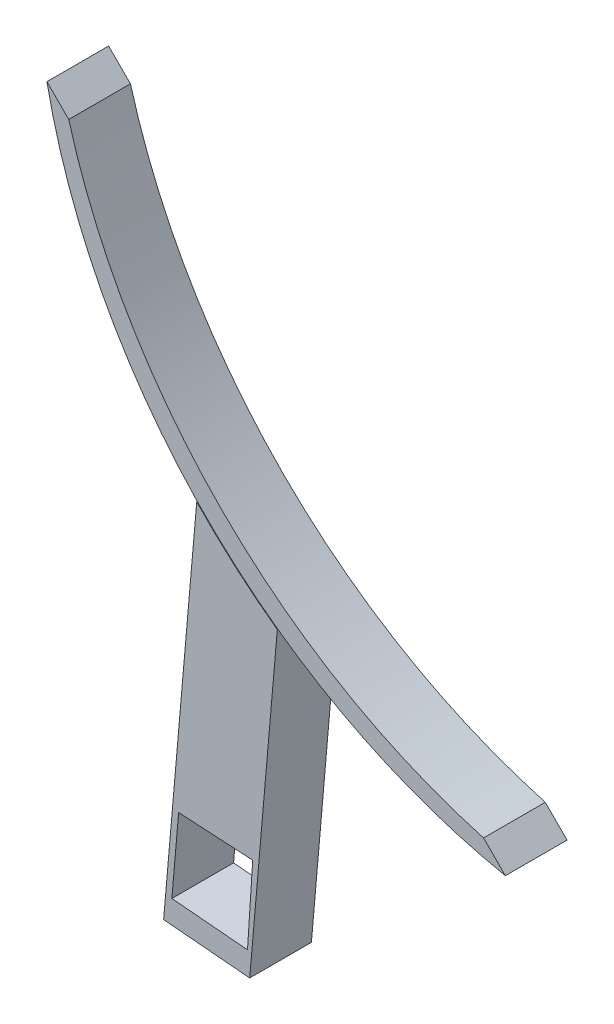
ISO-10303-21;
HEADER;
FILE_DESCRIPTION(('STEP AP214'),'2;1');
FILE_NAME('part.step','',(''),(''),'','','');
FILE_SCHEMA(('AUTOMOTIVE_DESIGN { 1 0 10303 214 1 1 1 1 }'));
ENDSEC;
DATA;
#1=APPLICATION_CONTEXT('core data for automotive mechanical design processes');
#2=APPLICATION_PROTOCOL_DEFINITION('international standard','automotive_design',2000,#1);
#3=PRODUCT_CONTEXT('',#1,'mechanical');
#4=PRODUCT('Part','Part','',(#3));
#5=PRODUCT_RELATED_PRODUCT_CATEGORY('part','',(#4));
#6=PRODUCT_DEFINITION_FORMATION('','',#4);
#7=PRODUCT_DEFINITION_CONTEXT('part definition',#1,'design');
#8=PRODUCT_DEFINITION('design','',#6,#7);
#9=PRODUCT_DEFINITION_SHAPE('','',#8);
#10=(LENGTH_UNIT() NAMED_UNIT(*) SI_UNIT(.MILLI.,.METRE.));
#11=(NAMED_UNIT(*) PLANE_ANGLE_UNIT() SI_UNIT($,.RADIAN.));
#12=(NAMED_UNIT(*) SI_UNIT($,.STERADIAN.) SOLID_ANGLE_UNIT());
#13=UNCERTAINTY_MEASURE_WITH_UNIT(LENGTH_MEASURE(1.E-05),#10,'distance_accuracy_value','');
#14=(GEOMETRIC_REPRESENTATION_CONTEXT(3) GLOBAL_UNCERTAINTY_ASSIGNED_CONTEXT((#13)) GLOBAL_UNIT_ASSIGNED_CONTEXT((#10,
#11,#12)) REPRESENTATION_CONTEXT('',''));
#15=CARTESIAN_POINT('',(0.,0.,0.));
#16=DIRECTION('',(0.,0.,1.));
#17=DIRECTION('',(1.,0.,0.));
#18=AXIS2_PLACEMENT_3D('',#15,#16,#17);
#19=CARTESIAN_POINT('',(28.3799536088554,45.4049632205257,7.5));
#20=DIRECTION('',(0.,0.,-1.));
#21=DIRECTION('',(-1.,0.,0.));
#22=AXIS2_PLACEMENT_3D('',#19,#20,#21);
#23=CYLINDRICAL_SURFACE('',#22,47.4894594322549);
#24=CARTESIAN_POINT('',(28.3799536088554,45.4049632205257,7.5));
#25=DIRECTION('',(0.,0.,1.));
#26=DIRECTION('',(-1.,0.,0.));
#27=AXIS2_PLACEMENT_3D('',#24,#25,#26);
#28=CIRCLE('',#27,47.4894594322549);
#29=CARTESIAN_POINT('',(0.540576615662491,6.93136388541464,7.5));
#30=VERTEX_POINT('',#29);
#31=CARTESIAN_POINT('',(18.9745039631687,-1.14378836456224,7.5));
#32=VERTEX_POINT('',#31);
#33=EDGE_CURVE('E233',#30,#32,#28,.T.);
#34=ORIENTED_EDGE('',*,*,#33,.F.);
#35=DIRECTION('',(0.,0.,-1.));
#36=VECTOR('',#35,1.);
#37=CARTESIAN_POINT('',(0.540576615662492,6.93136388541464,7.50000000000001));
#38=LINE('',#37,#36);
#39=CARTESIAN_POINT('',(0.540576615662492,6.93136388541464,2.54346717419688));
#40=VERTEX_POINT('',#39);
#41=EDGE_CURVE('E180',#30,#40,#38,.T.);
#42=ORIENTED_EDGE('',*,*,#41,.T.);
#43=CARTESIAN_POINT('',(28.3799536088554,45.4049632205257,2.54346717419687));
#44=DIRECTION('',(0.,0.,1.));
#45=DIRECTION('',(1.,0.,0.));
#46=AXIS2_PLACEMENT_3D('',#43,#44,#45);
#47=CIRCLE('',#46,47.4894594322549);
#48=CARTESIAN_POINT('',(-5.98750090869967,12.6310890651629,2.54346717419688));
#49=VERTEX_POINT('',#48);
#50=EDGE_CURVE('E191',#40,#49,#47,.F.);
#51=ORIENTED_EDGE('',*,*,#50,.T.);
#52=DIRECTION('',(0.,0.,-1.));
#53=VECTOR('',#52,1.);
#54=CARTESIAN_POINT('',(-5.98750090869967,12.6310890651629,7.5));
#55=LINE('',#54,#53);
#56=CARTESIAN_POINT('',(-5.98750090869967,12.6310890651629,7.5));
#57=VERTEX_POINT('',#56);
#58=EDGE_CURVE('E186',#49,#57,#55,.F.);
#59=ORIENTED_EDGE('',*,*,#58,.T.);
#60=CARTESIAN_POINT('',(-18.1687979762325,35.9995135748386,7.5));
#61=VERTEX_POINT('',#60);
#62=EDGE_CURVE('E227',#61,#57,#28,.T.);
#63=ORIENTED_EDGE('',*,*,#62,.F.);
#64=DIRECTION('',(0.,0.,-1.));
#65=VECTOR('',#64,1.);
#66=CARTESIAN_POINT('',(-18.1687979762325,35.9995135748386,7.5));
#67=LINE('',#66,#65);
#68=CARTESIAN_POINT('',(-18.1687979762325,35.9995135748386,2.5));
#69=VERTEX_POINT('',#68);
#70=EDGE_CURVE('E242',#61,#69,#67,.T.);
#71=ORIENTED_EDGE('',*,*,#70,.T.);
#72=CARTESIAN_POINT('',(28.3799536088554,45.4049632205257,2.5));
#73=DIRECTION('',(0.,0.,1.));
#74=DIRECTION('',(-1.,0.,0.));
#75=AXIS2_PLACEMENT_3D('',#72,#73,#74);
#76=CIRCLE('',#75,47.4894594322549);
#77=CARTESIAN_POINT('',(18.9745039631687,-1.14378836456224,2.5));
#78=VERTEX_POINT('',#77);
#79=EDGE_CURVE('E217',#69,#78,#76,.T.);
#80=ORIENTED_EDGE('',*,*,#79,.T.);
#81=DIRECTION('',(0.,0.,-1.));
#82=VECTOR('',#81,1.);
#83=CARTESIAN_POINT('',(18.9745039631687,-1.14378836456224,7.5));
#84=LINE('',#83,#82);
#85=EDGE_CURVE('E11',#32,#78,#84,.T.);
#86=ORIENTED_EDGE('',*,*,#85,.F.);
#87=EDGE_LOOP('',(#34,#42,#51,#59,#63,#71,#80,#86));
#88=FACE_BOUND('',#87,.T.);
#89=ADVANCED_FACE('F39',(#88),#23,.T.);
#90=CARTESIAN_POINT('',(18.9745039631687,-1.14378836456224,7.5));
#91=DIRECTION('',(-0.707106781186544,-0.707106781186552,0.));
#92=DIRECTION('',(0.707106781186551,-0.707106781186544,0.));
#93=AXIS2_PLACEMENT_3D('',#90,#91,#92);
#94=PLANE('',#93);
#95=DIRECTION('',(-0.707106781186552,0.707106781186544,0.));
#96=VECTOR('',#95,1.);
#97=CARTESIAN_POINT('',(18.9745039631687,-1.14378836456224,2.5));
#98=LINE('',#97,#96);
#99=CARTESIAN_POINT('',(17.2067370102023,0.623978588404122,2.5));
#100=VERTEX_POINT('',#99);
#101=EDGE_CURVE('E246',#78,#100,#98,.T.);
#102=ORIENTED_EDGE('',*,*,#101,.T.);
#103=DIRECTION('',(0.,0.,-1.));
#104=VECTOR('',#103,1.);
#105=CARTESIAN_POINT('',(17.2067370102023,0.623978588404122,7.5));
#106=LINE('',#105,#104);
#107=CARTESIAN_POINT('',(17.2067370102023,0.623978588404122,7.5));
#108=VERTEX_POINT('',#107);
#109=EDGE_CURVE('E47',#108,#100,#106,.T.);
#110=ORIENTED_EDGE('',*,*,#109,.F.);
#111=DIRECTION('',(-0.707106781186552,0.707106781186544,0.));
#112=VECTOR('',#111,1.);
#113=CARTESIAN_POINT('',(18.9745039631687,-1.14378836456224,7.5));
#114=LINE('',#113,#112);
#115=EDGE_CURVE('E231',#32,#108,#114,.T.);
#116=ORIENTED_EDGE('',*,*,#115,.F.);
#117=ORIENTED_EDGE('',*,*,#85,.T.);
#118=EDGE_LOOP('',(#102,#110,#116,#117));
#119=FACE_BOUND('',#118,.T.);
#120=ADVANCED_FACE('F287',(#119),#94,.F.);
#121=CARTESIAN_POINT('',(30.267113065966,47.2921226776364,7.5));
#122=DIRECTION('',(0.,0.,-1.));
#123=DIRECTION('',(-1.,0.,0.));
#124=AXIS2_PLACEMENT_3D('',#121,#122,#123);
#125=CYLINDRICAL_SURFACE('',#124,48.4612122779787);
#126=CARTESIAN_POINT('',(30.267113065966,47.2921226776364,2.5));
#127=DIRECTION('',(0.,0.,-1.));
#128=DIRECTION('',(-1.,0.,0.));
#129=AXIS2_PLACEMENT_3D('',#126,#127,#128);
#130=CIRCLE('',#129,48.4612122779787);
#131=CARTESIAN_POINT('',(-16.4010310232661,34.2317466218722,2.5));
#132=VERTEX_POINT('',#131);
#133=EDGE_CURVE('E249',#100,#132,#130,.T.);
#134=ORIENTED_EDGE('',*,*,#133,.T.);
#135=DIRECTION('',(0.,0.,-1.));
#136=VECTOR('',#135,1.);
#137=CARTESIAN_POINT('',(-16.4010310232661,34.2317466218722,7.5));
#138=LINE('',#137,#136);
#139=CARTESIAN_POINT('',(-16.4010310232661,34.2317466218722,7.5));
#140=VERTEX_POINT('',#139);
#141=EDGE_CURVE('E258',#140,#132,#138,.T.);
#142=ORIENTED_EDGE('',*,*,#141,.F.);
#143=CARTESIAN_POINT('',(30.267113065966,47.2921226776364,7.5));
#144=DIRECTION('',(0.,0.,-1.));
#145=DIRECTION('',(-1.,0.,0.));
#146=AXIS2_PLACEMENT_3D('',#143,#144,#145);
#147=CIRCLE('',#146,48.4612122779787);
#148=EDGE_CURVE('E236',#108,#140,#147,.T.);
#149=ORIENTED_EDGE('',*,*,#148,.F.);
#150=ORIENTED_EDGE('',*,*,#109,.T.);
#151=EDGE_LOOP('',(#134,#142,#149,#150));
#152=FACE_BOUND('',#151,.T.);
#153=ADVANCED_FACE('F267',(#152),#125,.F.);
#154=CARTESIAN_POINT('',(-18.1687979762325,35.9995135748386,7.5));
#155=DIRECTION('',(-0.707106781186544,-0.707106781186551,0.));
#156=DIRECTION('',(0.707106781186551,-0.707106781186544,0.));
#157=AXIS2_PLACEMENT_3D('',#154,#155,#156);
#158=PLANE('',#157);
#159=DIRECTION('',(-0.707106781186551,0.707106781186544,0.));
#160=VECTOR('',#159,1.);
#161=CARTESIAN_POINT('',(-18.1687979762325,35.9995135748386,2.5));
#162=LINE('',#161,#160);
#163=EDGE_CURVE('E252',#132,#69,#162,.T.);
#164=ORIENTED_EDGE('',*,*,#163,.T.);
#165=ORIENTED_EDGE('',*,*,#70,.F.);
#166=DIRECTION('',(-0.707106781186551,0.707106781186544,0.));
#167=VECTOR('',#166,1.);
#168=CARTESIAN_POINT('',(-18.1687979762325,35.9995135748386,7.5));
#169=LINE('',#168,#167);
#170=EDGE_CURVE('E239',#140,#61,#169,.T.);
#171=ORIENTED_EDGE('',*,*,#170,.F.);
#172=ORIENTED_EDGE('',*,*,#141,.T.);
#173=EDGE_LOOP('',(#164,#165,#171,#172));
#174=FACE_BOUND('',#173,.T.);
#175=ADVANCED_FACE('F277',(#174),#158,.F.);
#176=CARTESIAN_POINT('',(28.3799536088554,45.4049632205257,7.5));
#177=DIRECTION('',(0.,0.,-1.));
#178=DIRECTION('',(-1.,0.,0.));
#179=AXIS2_PLACEMENT_3D('',#176,#177,#178);
#180=PLANE('',#179);
#181=ORIENTED_EDGE('',*,*,#62,.T.);
#182=EDGE_CURVE('E232',#57,#30,#28,.T.);
#183=ORIENTED_EDGE('',*,*,#182,.T.);
#184=ORIENTED_EDGE('',*,*,#33,.T.);
#185=ORIENTED_EDGE('',*,*,#115,.T.);
#186=ORIENTED_EDGE('',*,*,#148,.T.);
#187=ORIENTED_EDGE('',*,*,#170,.T.);
#188=EDGE_LOOP('',(#181,#183,#184,#185,#186,#187));
#189=FACE_BOUND('',#188,.T.);
#190=ADVANCED_FACE('F286',(#189),#180,.F.);
#191=CARTESIAN_POINT('',(28.3799536088554,45.4049632205257,2.5));
#192=DIRECTION('',(0.,0.,-1.));
#193=DIRECTION('',(-1.,0.,0.));
#194=AXIS2_PLACEMENT_3D('',#191,#192,#193);
#195=PLANE('',#194);
#196=ORIENTED_EDGE('',*,*,#79,.F.);
#197=ORIENTED_EDGE('',*,*,#163,.F.);
#198=ORIENTED_EDGE('',*,*,#133,.F.);
#199=ORIENTED_EDGE('',*,*,#101,.F.);
#200=EDGE_LOOP('',(#196,#197,#198,#199));
#201=FACE_BOUND('',#200,.T.);
#202=ADVANCED_FACE('F274',(#201),#195,.T.);
#203=CARTESIAN_POINT('',(28.3799536088554,45.4049632205257,7.5));
#204=DIRECTION('',(0.,0.,-1.));
#205=DIRECTION('',(-1.,0.,0.));
#206=AXIS2_PLACEMENT_3D('',#203,#204,#205);
#207=CYLINDRICAL_SURFACE('',#206,47.4894594322549);
#208=ORIENTED_EDGE('',*,*,#182,.F.);
#209=CARTESIAN_POINT('',(-5.98750090869967,12.6310890651629,7.54346717419688));
#210=VERTEX_POINT('',#209);
#211=EDGE_CURVE('E190',#57,#210,#55,.F.);
#212=ORIENTED_EDGE('',*,*,#211,.T.);
#213=CARTESIAN_POINT('',(28.3799536088554,45.4049632205257,7.54346717419687));
#214=DIRECTION('',(0.,0.,-1.));
#215=DIRECTION('',(-1.,0.,0.));
#216=AXIS2_PLACEMENT_3D('',#213,#214,#215);
#217=CIRCLE('',#216,47.4894594322549);
#218=CARTESIAN_POINT('',(0.54057661566249,6.93136388541465,7.54346717419687));
#219=VERTEX_POINT('',#218);
#220=EDGE_CURVE('E181',#210,#219,#217,.F.);
#221=ORIENTED_EDGE('',*,*,#220,.T.);
#222=EDGE_CURVE('E195',#219,#30,#38,.T.);
#223=ORIENTED_EDGE('',*,*,#222,.T.);
#224=EDGE_LOOP('',(#208,#212,#221,#223));
#225=FACE_BOUND('',#224,.T.);
#226=ADVANCED_FACE('F296',(#225),#207,.F.);
#227=CARTESIAN_POINT('',(-8.669481527788,-18.0240896860062,2.54346717419688));
#228=DIRECTION('',(0.,0.,-1.));
#229=DIRECTION('',(-1.,0.,0.));
#230=AXIS2_PLACEMENT_3D('',#227,#228,#229);
#231=PLANE('',#230);
#232=DIRECTION('',(-0.0648516956035932,-0.997894913093227,0.));
#233=VECTOR('',#232,1.);
#234=CARTESIAN_POINT('',(-1.98574926808029,-18.4584554336569,2.54346717419688));
#235=LINE('',#234,#233);
#236=CARTESIAN_POINT('',(-1.45199004839346,-10.2453222968173,2.54346717419688));
#237=VERTEX_POINT('',#236);
#238=CARTESIAN_POINT('',(-1.8744153117077,-16.7453222968173,2.54346717419688));
#239=VERTEX_POINT('',#238);
#240=EDGE_CURVE('E177',#237,#239,#235,.T.);
#241=ORIENTED_EDGE('',*,*,#240,.F.);
#242=DIRECTION('',(-0.998343017585793,0.0575431945384743,0.));
#243=VECTOR('',#242,1.);
#244=CARTESIAN_POINT('',(-8.19870939639861,-9.85645015858412,2.54346717419688));
#245=LINE('',#244,#243);
#246=CARTESIAN_POINT('',(-7.45199004839346,-9.89949009170432,2.54346717419688));
#247=VERTEX_POINT('',#246);
#248=EDGE_CURVE('E165',#237,#247,#245,.T.);
#249=ORIENTED_EDGE('',*,*,#248,.T.);
#250=DIRECTION('',(-0.0871557427476555,-0.996194698091746,0.));
#251=VECTOR('',#250,1.);
#252=CARTESIAN_POINT('',(-8.16664922093569,-18.0680818125104,2.54346717419688));
#253=LINE('',#252,#251);
#254=CARTESIAN_POINT('',(-8.00400524541287,-16.2090526655555,2.54346717419688));
#255=VERTEX_POINT('',#254);
#256=EDGE_CURVE('E140',#247,#255,#253,.T.);
#257=ORIENTED_EDGE('',*,*,#256,.T.);
#258=DIRECTION('',(-0.996194698091746,0.0871557427476561,0.));
#259=VECTOR('',#258,1.);
#260=CARTESIAN_POINT('',(-8.50683755226518,-16.1650605390513,2.54346717419688));
#261=LINE('',#260,#259);
#262=EDGE_CURVE('E174',#239,#255,#261,.T.);
#263=ORIENTED_EDGE('',*,*,#262,.F.);
#264=EDGE_LOOP('',(#241,#249,#257,#263));
#265=FACE_BOUND('',#264,.T.);
#266=DIRECTION('',(0.087155742747666,0.996194698091745,0.));
#267=VECTOR('',#266,1.);
#268=CARTESIAN_POINT('',(-8.669481527788,-18.0240896860062,2.54346717419688));
#269=LINE('',#268,#267);
#270=CARTESIAN_POINT('',(-8.669481527788,-18.0240896860062,2.54346717419688));
#271=VERTEX_POINT('',#270);
#272=EDGE_CURVE('E213',#271,#49,#269,.T.);
#273=ORIENTED_EDGE('',*,*,#272,.T.);
#274=ORIENTED_EDGE('',*,*,#50,.F.);
#275=DIRECTION('',(0.087155742747666,0.996194698091745,0.));
#276=VECTOR('',#275,1.);
#277=CARTESIAN_POINT('',(-1.69611864114579,-18.6341798852399,2.54346717419688));
#278=LINE('',#277,#276);
#279=CARTESIAN_POINT('',(-1.69611864114579,-18.6341798852399,2.54346717419688));
#280=VERTEX_POINT('',#279);
#281=EDGE_CURVE('E214',#280,#40,#278,.T.);
#282=ORIENTED_EDGE('',*,*,#281,.F.);
#283=DIRECTION('',(-0.996194698091745,0.0871557427476659,0.));
#284=VECTOR('',#283,1.);
#285=CARTESIAN_POINT('',(-8.669481527788,-18.0240896860062,2.54346717419688));
#286=LINE('',#285,#284);
#287=EDGE_CURVE('E185',#280,#271,#286,.T.);
#288=ORIENTED_EDGE('',*,*,#287,.T.);
#289=EDGE_LOOP('',(#273,#274,#282,#288));
#290=FACE_BOUND('',#289,.T.);
#291=ADVANCED_FACE('F309',(#265,#290),#231,.T.);
#292=CARTESIAN_POINT('',(-1.69611864114579,-18.6341798852399,2.54346717419688));
#293=DIRECTION('',(0.996194698091745,-0.087155742747666,0.));
#294=DIRECTION('',(0.087155742747666,0.996194698091745,0.));
#295=AXIS2_PLACEMENT_3D('',#292,#293,#294);
#296=PLANE('',#295);
#297=ORIENTED_EDGE('',*,*,#281,.T.);
#298=ORIENTED_EDGE('',*,*,#41,.F.);
#299=ORIENTED_EDGE('',*,*,#222,.F.);
#300=DIRECTION('',(0.087155742747666,0.996194698091745,0.));
#301=VECTOR('',#300,1.);
#302=CARTESIAN_POINT('',(-1.69611864114579,-18.6341798852399,7.54346717419687));
#303=LINE('',#302,#301);
#304=CARTESIAN_POINT('',(-1.69611864114579,-18.6341798852399,7.54346717419687));
#305=VERTEX_POINT('',#304);
#306=EDGE_CURVE('E218',#305,#219,#303,.T.);
#307=ORIENTED_EDGE('',*,*,#306,.F.);
#308=DIRECTION('',(0.,0.,-1.));
#309=VECTOR('',#308,1.);
#310=CARTESIAN_POINT('',(-1.69611864114579,-18.6341798852399,2.54346717419688));
#311=LINE('',#310,#309);
#312=EDGE_CURVE('E209',#305,#280,#311,.T.);
#313=ORIENTED_EDGE('',*,*,#312,.T.);
#314=EDGE_LOOP('',(#297,#298,#299,#307,#313));
#315=FACE_BOUND('',#314,.T.);
#316=ADVANCED_FACE('F305',(#315),#296,.T.);
#317=CARTESIAN_POINT('',(-8.669481527788,-18.0240896860062,7.54346717419688));
#318=DIRECTION('',(0.,0.,1.));
#319=DIRECTION('',(1.,0.,0.));
#320=AXIS2_PLACEMENT_3D('',#317,#318,#319);
#321=PLANE('',#320);
#322=DIRECTION('',(0.0648516956035932,0.997894913093227,0.));
#323=VECTOR('',#322,1.);
#324=CARTESIAN_POINT('',(-1.8744153117077,-16.7453222968173,7.54346717419687));
#325=LINE('',#324,#323);
#326=CARTESIAN_POINT('',(-1.8744153117077,-16.7453222968173,7.54346717419687));
#327=VERTEX_POINT('',#326);
#328=CARTESIAN_POINT('',(-1.45199004839345,-10.2453222968173,7.54346717419687));
#329=VERTEX_POINT('',#328);
#330=EDGE_CURVE('E62',#327,#329,#325,.T.);
#331=ORIENTED_EDGE('',*,*,#330,.F.);
#332=DIRECTION('',(0.996194698091746,-0.0871557427476561,0.));
#333=VECTOR('',#332,1.);
#334=CARTESIAN_POINT('',(-8.00400524541287,-16.2090526655555,7.54346717419687));
#335=LINE('',#334,#333);
#336=CARTESIAN_POINT('',(-8.00400524541287,-16.2090526655555,7.54346717419687));
#337=VERTEX_POINT('',#336);
#338=EDGE_CURVE('E155',#337,#327,#335,.T.);
#339=ORIENTED_EDGE('',*,*,#338,.F.);
#340=DIRECTION('',(0.0871557427476555,0.996194698091746,0.));
#341=VECTOR('',#340,1.);
#342=CARTESIAN_POINT('',(-8.00400524541287,-16.2090526655555,7.54346717419687));
#343=LINE('',#342,#341);
#344=CARTESIAN_POINT('',(-7.45199004839346,-9.89949009170432,7.54346717419687));
#345=VERTEX_POINT('',#344);
#346=EDGE_CURVE('E137',#337,#345,#343,.T.);
#347=ORIENTED_EDGE('',*,*,#346,.T.);
#348=DIRECTION('',(0.998343017585793,-0.0575431945384743,0.));
#349=VECTOR('',#348,1.);
#350=CARTESIAN_POINT('',(-7.45199004839346,-9.89949009170432,7.54346717419687));
#351=LINE('',#350,#349);
#352=EDGE_CURVE('E147',#345,#329,#351,.T.);
#353=ORIENTED_EDGE('',*,*,#352,.T.);
#354=EDGE_LOOP('',(#331,#339,#347,#353));
#355=FACE_BOUND('',#354,.T.);
#356=ORIENTED_EDGE('',*,*,#306,.T.);
#357=ORIENTED_EDGE('',*,*,#220,.F.);
#358=DIRECTION('',(0.087155742747666,0.996194698091745,0.));
#359=VECTOR('',#358,1.);
#360=CARTESIAN_POINT('',(-8.669481527788,-18.0240896860062,7.54346717419688));
#361=LINE('',#360,#359);
#362=CARTESIAN_POINT('',(-8.669481527788,-18.0240896860062,7.54346717419688));
#363=VERTEX_POINT('',#362);
#364=EDGE_CURVE('E221',#363,#210,#361,.T.);
#365=ORIENTED_EDGE('',*,*,#364,.F.);
#366=DIRECTION('',(0.996194698091745,-0.0871557427476659,0.));
#367=VECTOR('',#366,1.);
#368=CARTESIAN_POINT('',(-8.669481527788,-18.0240896860062,7.54346717419688));
#369=LINE('',#368,#367);
#370=EDGE_CURVE('E205',#363,#305,#369,.T.);
#371=ORIENTED_EDGE('',*,*,#370,.T.);
#372=EDGE_LOOP('',(#356,#357,#365,#371));
#373=FACE_BOUND('',#372,.T.);
#374=ADVANCED_FACE('F152',(#355,#373),#321,.T.);
#375=CARTESIAN_POINT('',(-8.669481527788,-18.0240896860062,2.54346717419688));
#376=DIRECTION('',(-0.996194698091745,0.087155742747666,0.));
#377=DIRECTION('',(-0.087155742747666,-0.996194698091745,0.));
#378=AXIS2_PLACEMENT_3D('',#375,#376,#377);
#379=PLANE('',#378);
#380=ORIENTED_EDGE('',*,*,#364,.T.);
#381=ORIENTED_EDGE('',*,*,#211,.F.);
#382=ORIENTED_EDGE('',*,*,#58,.F.);
#383=ORIENTED_EDGE('',*,*,#272,.F.);
#384=DIRECTION('',(0.,0.,1.));
#385=VECTOR('',#384,1.);
#386=CARTESIAN_POINT('',(-8.669481527788,-18.0240896860062,2.54346717419688));
#387=LINE('',#386,#385);
#388=EDGE_CURVE('E201',#271,#363,#387,.T.);
#389=ORIENTED_EDGE('',*,*,#388,.T.);
#390=EDGE_LOOP('',(#380,#381,#382,#383,#389));
#391=FACE_BOUND('',#390,.T.);
#392=ADVANCED_FACE('F299',(#391),#379,.T.);
#393=CARTESIAN_POINT('',(-1.63077961635343,-18.6398963091951,0.));
#394=DIRECTION('',(-0.0871557427476659,-0.996194698091745,0.));
#395=DIRECTION('',(0.996194698091745,-0.0871557427476659,0.));
#396=AXIS2_PLACEMENT_3D('',#393,#394,#395);
#397=PLANE('',#396);
#398=ORIENTED_EDGE('',*,*,#287,.F.);
#399=ORIENTED_EDGE('',*,*,#312,.F.);
#400=ORIENTED_EDGE('',*,*,#370,.F.);
#401=ORIENTED_EDGE('',*,*,#388,.F.);
#402=EDGE_LOOP('',(#398,#399,#400,#401));
#403=FACE_BOUND('',#402,.T.);
#404=ADVANCED_FACE('F311',(#403),#397,.T.);
#405=CARTESIAN_POINT('',(-1.8744153117077,-16.7453222968173,2.5));
#406=DIRECTION('',(0.997894913093227,-0.0648516956035932,0.));
#407=DIRECTION('',(0.0648516956035932,0.997894913093227,0.));
#408=AXIS2_PLACEMENT_3D('',#405,#406,#407);
#409=PLANE('',#408);
#410=ORIENTED_EDGE('',*,*,#240,.T.);
#411=DIRECTION('',(0.,0.,1.));
#412=VECTOR('',#411,1.);
#413=CARTESIAN_POINT('',(-1.8744153117077,-16.7453222968173,2.5));
#414=LINE('',#413,#412);
#415=EDGE_CURVE('E162',#239,#327,#414,.T.);
#416=ORIENTED_EDGE('',*,*,#415,.T.);
#417=ORIENTED_EDGE('',*,*,#330,.T.);
#418=DIRECTION('',(0.,0.,1.));
#419=VECTOR('',#418,1.);
#420=CARTESIAN_POINT('',(-1.45199004839346,-10.2453222968173,2.5));
#421=LINE('',#420,#419);
#422=EDGE_CURVE('E144',#237,#329,#421,.T.);
#423=ORIENTED_EDGE('',*,*,#422,.F.);
#424=EDGE_LOOP('',(#410,#416,#417,#423));
#425=FACE_BOUND('',#424,.T.);
#426=ADVANCED_FACE('F313',(#425),#409,.F.);
#427=CARTESIAN_POINT('',(-8.00400524541287,-16.2090526655555,2.5));
#428=DIRECTION('',(-0.0871557427476561,-0.996194698091746,0.));
#429=DIRECTION('',(0.996194698091746,-0.0871557427476561,0.));
#430=AXIS2_PLACEMENT_3D('',#427,#428,#429);
#431=PLANE('',#430);
#432=ORIENTED_EDGE('',*,*,#262,.T.);
#433=DIRECTION('',(0.,0.,1.));
#434=VECTOR('',#433,1.);
#435=CARTESIAN_POINT('',(-8.00400524541287,-16.2090526655555,2.5));
#436=LINE('',#435,#434);
#437=EDGE_CURVE('E143',#255,#337,#436,.T.);
#438=ORIENTED_EDGE('',*,*,#437,.T.);
#439=ORIENTED_EDGE('',*,*,#338,.T.);
#440=ORIENTED_EDGE('',*,*,#415,.F.);
#441=EDGE_LOOP('',(#432,#438,#439,#440));
#442=FACE_BOUND('',#441,.T.);
#443=ADVANCED_FACE('F319',(#442),#431,.F.);
#444=CARTESIAN_POINT('',(-8.00400524541287,-16.2090526655555,2.5));
#445=DIRECTION('',(0.996194698091746,-0.0871557427476555,0.));
#446=DIRECTION('',(0.0871557427476555,0.996194698091746,0.));
#447=AXIS2_PLACEMENT_3D('',#444,#445,#446);
#448=PLANE('',#447);
#449=DIRECTION('',(0.,0.,1.));
#450=VECTOR('',#449,1.);
#451=CARTESIAN_POINT('',(-7.45199004839346,-9.89949009170432,2.5));
#452=LINE('',#451,#450);
#453=EDGE_CURVE('E54',#247,#345,#452,.T.);
#454=ORIENTED_EDGE('',*,*,#453,.T.);
#455=ORIENTED_EDGE('',*,*,#346,.F.);
#456=ORIENTED_EDGE('',*,*,#437,.F.);
#457=ORIENTED_EDGE('',*,*,#256,.F.);
#458=EDGE_LOOP('',(#454,#455,#456,#457));
#459=FACE_BOUND('',#458,.T.);
#460=ADVANCED_FACE('F134',(#459),#448,.T.);
#461=CARTESIAN_POINT('',(-7.45199004839346,-9.89949009170432,2.5));
#462=DIRECTION('',(-0.0575431945384743,-0.998343017585793,0.));
#463=DIRECTION('',(0.998343017585793,-0.0575431945384743,0.));
#464=AXIS2_PLACEMENT_3D('',#461,#462,#463);
#465=PLANE('',#464);
#466=ORIENTED_EDGE('',*,*,#422,.T.);
#467=ORIENTED_EDGE('',*,*,#352,.F.);
#468=ORIENTED_EDGE('',*,*,#453,.F.);
#469=ORIENTED_EDGE('',*,*,#248,.F.);
#470=EDGE_LOOP('',(#466,#467,#468,#469));
#471=FACE_BOUND('',#470,.T.);
#472=ADVANCED_FACE('F148',(#471),#465,.T.);
#473=CLOSED_SHELL('',(#89,#120,#153,#175,#190,#202,#226,#291,#316,#374,#392,#404,#426,#443,#460,#472));
#474=MANIFOLD_SOLID_BREP('B2',#473);
#475=ADVANCED_BREP_SHAPE_REPRESENTATION('',(#18,#474),#14);
#476=SHAPE_DEFINITION_REPRESENTATION(#9,#475);
ENDSEC;
END-ISO-10303-21;
